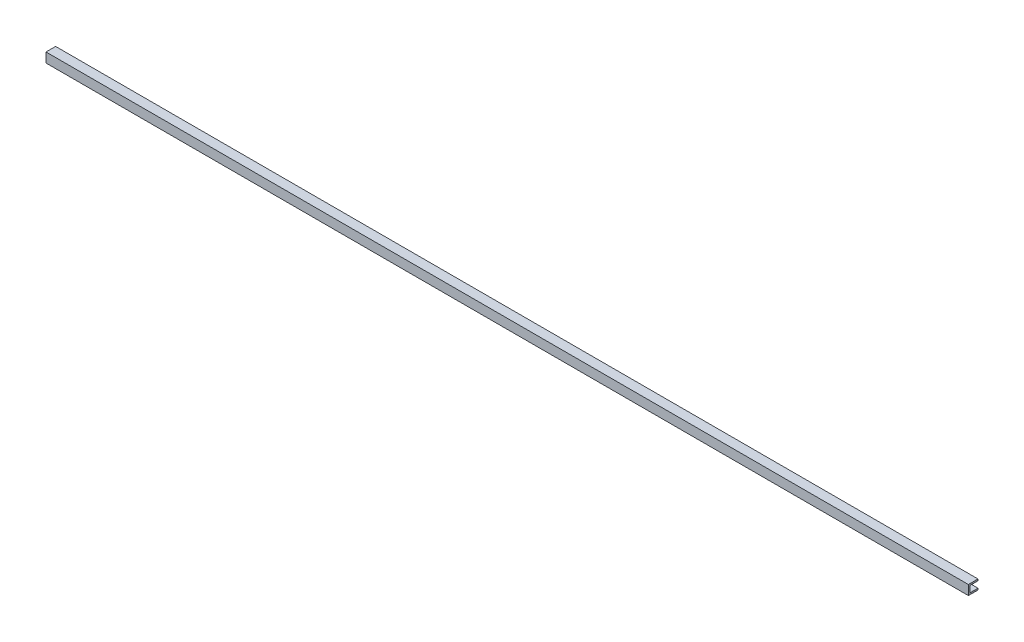
ISO-10303-21;
HEADER;
FILE_DESCRIPTION(('STEP AP214'),'2;1');
FILE_NAME('part.step','',(''),(''),'','','');
FILE_SCHEMA(('AUTOMOTIVE_DESIGN { 1 0 10303 214 1 1 1 1 }'));
ENDSEC;
DATA;
#1=APPLICATION_CONTEXT('core data for automotive mechanical design processes');
#2=APPLICATION_PROTOCOL_DEFINITION('international standard','automotive_design',2000,#1);
#3=PRODUCT_CONTEXT('',#1,'mechanical');
#4=PRODUCT('Part','Part','',(#3));
#5=PRODUCT_RELATED_PRODUCT_CATEGORY('part','',(#4));
#6=PRODUCT_DEFINITION_FORMATION('','',#4);
#7=PRODUCT_DEFINITION_CONTEXT('part definition',#1,'design');
#8=PRODUCT_DEFINITION('design','',#6,#7);
#9=PRODUCT_DEFINITION_SHAPE('','',#8);
#10=(LENGTH_UNIT() NAMED_UNIT(*) SI_UNIT(.MILLI.,.METRE.));
#11=(NAMED_UNIT(*) PLANE_ANGLE_UNIT() SI_UNIT($,.RADIAN.));
#12=(NAMED_UNIT(*) SI_UNIT($,.STERADIAN.) SOLID_ANGLE_UNIT());
#13=UNCERTAINTY_MEASURE_WITH_UNIT(LENGTH_MEASURE(1.E-05),#10,'distance_accuracy_value','');
#14=(GEOMETRIC_REPRESENTATION_CONTEXT(3) GLOBAL_UNCERTAINTY_ASSIGNED_CONTEXT((#13)) GLOBAL_UNIT_ASSIGNED_CONTEXT((#10,
#11,#12)) REPRESENTATION_CONTEXT('',''));
#15=CARTESIAN_POINT('',(0.,0.,0.));
#16=DIRECTION('',(0.,0.,1.));
#17=DIRECTION('',(1.,0.,0.));
#18=AXIS2_PLACEMENT_3D('',#15,#16,#17);
#19=CARTESIAN_POINT('',(-914.4,-9.525,0.));
#20=DIRECTION('',(0.,-1.,0.));
#21=DIRECTION('',(0.,0.,-1.));
#22=AXIS2_PLACEMENT_3D('',#19,#20,#21);
#23=PLANE('',#22);
#24=DIRECTION('',(1.,0.,0.));
#25=VECTOR('',#24,1.);
#26=CARTESIAN_POINT('',(-914.4,-9.525,0.));
#27=LINE('',#26,#25);
#28=CARTESIAN_POINT('',(-914.4,-9.525,0.));
#29=VERTEX_POINT('',#28);
#30=CARTESIAN_POINT('',(914.4,-9.525,0.));
#31=VERTEX_POINT('',#30);
#32=EDGE_CURVE('E84',#29,#31,#27,.T.);
#33=ORIENTED_EDGE('',*,*,#32,.F.);
#34=DIRECTION('',(0.,0.,-1.));
#35=VECTOR('',#34,1.);
#36=CARTESIAN_POINT('',(-914.4,-9.525,0.));
#37=LINE('',#36,#35);
#38=CARTESIAN_POINT('',(-914.4,-9.525,-19.05));
#39=VERTEX_POINT('',#38);
#40=EDGE_CURVE('E123',#29,#39,#37,.T.);
#41=ORIENTED_EDGE('',*,*,#40,.T.);
#42=DIRECTION('',(-1.,0.,0.));
#43=VECTOR('',#42,1.);
#44=CARTESIAN_POINT('',(-914.4,-9.525,-19.05));
#45=LINE('',#44,#43);
#46=CARTESIAN_POINT('',(914.4,-9.525,-19.05));
#47=VERTEX_POINT('',#46);
#48=EDGE_CURVE('E20',#47,#39,#45,.T.);
#49=ORIENTED_EDGE('',*,*,#48,.F.);
#50=DIRECTION('',(0.,0.,-1.));
#51=VECTOR('',#50,1.);
#52=CARTESIAN_POINT('',(914.4,-9.525,0.));
#53=LINE('',#52,#51);
#54=EDGE_CURVE('E95',#31,#47,#53,.T.);
#55=ORIENTED_EDGE('',*,*,#54,.F.);
#56=EDGE_LOOP('',(#33,#41,#49,#55));
#57=FACE_BOUND('',#56,.T.);
#58=ADVANCED_FACE('F17',(#57),#23,.T.);
#59=CARTESIAN_POINT('',(-914.4,-9.525,-19.05));
#60=DIRECTION('',(0.,0.,-1.));
#61=DIRECTION('',(-1.,0.,0.));
#62=AXIS2_PLACEMENT_3D('',#59,#60,#61);
#63=PLANE('',#62);
#64=ORIENTED_EDGE('',*,*,#48,.T.);
#65=DIRECTION('',(0.,1.,0.));
#66=VECTOR('',#65,1.);
#67=CARTESIAN_POINT('',(-914.4,0.,-19.05));
#68=LINE('',#67,#66);
#69=CARTESIAN_POINT('',(-914.4,-6.35,-19.05));
#70=VERTEX_POINT('',#69);
#71=EDGE_CURVE('E119',#39,#70,#68,.T.);
#72=ORIENTED_EDGE('',*,*,#71,.T.);
#73=DIRECTION('',(1.,0.,0.));
#74=VECTOR('',#73,1.);
#75=CARTESIAN_POINT('',(-914.4,-6.35,-19.05));
#76=LINE('',#75,#74);
#77=CARTESIAN_POINT('',(914.4,-6.35,-19.05));
#78=VERTEX_POINT('',#77);
#79=EDGE_CURVE('E111',#78,#70,#76,.F.);
#80=ORIENTED_EDGE('',*,*,#79,.F.);
#81=DIRECTION('',(0.,1.,0.));
#82=VECTOR('',#81,1.);
#83=CARTESIAN_POINT('',(914.4,0.,-19.05));
#84=LINE('',#83,#82);
#85=EDGE_CURVE('E98',#47,#78,#84,.T.);
#86=ORIENTED_EDGE('',*,*,#85,.F.);
#87=EDGE_LOOP('',(#64,#72,#80,#86));
#88=FACE_BOUND('',#87,.T.);
#89=ADVANCED_FACE('F118',(#88),#63,.T.);
#90=CARTESIAN_POINT('',(-914.4,-6.35,-19.05));
#91=DIRECTION('',(0.,1.,0.));
#92=DIRECTION('',(0.,0.,1.));
#93=AXIS2_PLACEMENT_3D('',#90,#91,#92);
#94=PLANE('',#93);
#95=ORIENTED_EDGE('',*,*,#79,.T.);
#96=DIRECTION('',(0.,0.,-1.));
#97=VECTOR('',#96,1.);
#98=CARTESIAN_POINT('',(-914.4,-6.35,0.));
#99=LINE('',#98,#97);
#100=CARTESIAN_POINT('',(-914.4,-6.35,-3.175));
#101=VERTEX_POINT('',#100);
#102=EDGE_CURVE('E125',#70,#101,#99,.F.);
#103=ORIENTED_EDGE('',*,*,#102,.T.);
#104=DIRECTION('',(-1.,0.,0.));
#105=VECTOR('',#104,1.);
#106=CARTESIAN_POINT('',(-914.4,-6.35,-3.175));
#107=LINE('',#106,#105);
#108=CARTESIAN_POINT('',(914.4,-6.35,-3.175));
#109=VERTEX_POINT('',#108);
#110=EDGE_CURVE('E109',#109,#101,#107,.T.);
#111=ORIENTED_EDGE('',*,*,#110,.F.);
#112=DIRECTION('',(0.,0.,-1.));
#113=VECTOR('',#112,1.);
#114=CARTESIAN_POINT('',(914.4,-6.35,0.));
#115=LINE('',#114,#113);
#116=EDGE_CURVE('E143',#78,#109,#115,.F.);
#117=ORIENTED_EDGE('',*,*,#116,.F.);
#118=EDGE_LOOP('',(#95,#103,#111,#117));
#119=FACE_BOUND('',#118,.T.);
#120=ADVANCED_FACE('F146',(#119),#94,.T.);
#121=CARTESIAN_POINT('',(-914.4,-6.35,-3.175));
#122=DIRECTION('',(0.,0.,-1.));
#123=DIRECTION('',(-1.,0.,0.));
#124=AXIS2_PLACEMENT_3D('',#121,#122,#123);
#125=PLANE('',#124);
#126=ORIENTED_EDGE('',*,*,#110,.T.);
#127=DIRECTION('',(0.,1.,0.));
#128=VECTOR('',#127,1.);
#129=CARTESIAN_POINT('',(-914.4,0.,-3.175));
#130=LINE('',#129,#128);
#131=CARTESIAN_POINT('',(-914.4,6.35,-3.175));
#132=VERTEX_POINT('',#131);
#133=EDGE_CURVE('E127',#101,#132,#130,.T.);
#134=ORIENTED_EDGE('',*,*,#133,.T.);
#135=DIRECTION('',(1.,0.,0.));
#136=VECTOR('',#135,1.);
#137=CARTESIAN_POINT('',(-914.4,6.35,-3.175));
#138=LINE('',#137,#136);
#139=CARTESIAN_POINT('',(914.4,6.35,-3.175));
#140=VERTEX_POINT('',#139);
#141=EDGE_CURVE('E92',#140,#132,#138,.F.);
#142=ORIENTED_EDGE('',*,*,#141,.F.);
#143=DIRECTION('',(0.,1.,0.));
#144=VECTOR('',#143,1.);
#145=CARTESIAN_POINT('',(914.4,0.,-3.175));
#146=LINE('',#145,#144);
#147=EDGE_CURVE('E140',#109,#140,#146,.T.);
#148=ORIENTED_EDGE('',*,*,#147,.F.);
#149=EDGE_LOOP('',(#126,#134,#142,#148));
#150=FACE_BOUND('',#149,.T.);
#151=ADVANCED_FACE('F148',(#150),#125,.T.);
#152=CARTESIAN_POINT('',(-914.4,6.35,-3.175));
#153=DIRECTION('',(0.,-1.,0.));
#154=DIRECTION('',(0.,0.,-1.));
#155=AXIS2_PLACEMENT_3D('',#152,#153,#154);
#156=PLANE('',#155);
#157=ORIENTED_EDGE('',*,*,#141,.T.);
#158=DIRECTION('',(0.,0.,-1.));
#159=VECTOR('',#158,1.);
#160=CARTESIAN_POINT('',(-914.4,6.35,0.));
#161=LINE('',#160,#159);
#162=CARTESIAN_POINT('',(-914.4,6.35,-19.05));
#163=VERTEX_POINT('',#162);
#164=EDGE_CURVE('E163',#132,#163,#161,.T.);
#165=ORIENTED_EDGE('',*,*,#164,.T.);
#166=DIRECTION('',(-1.,0.,0.));
#167=VECTOR('',#166,1.);
#168=CARTESIAN_POINT('',(-914.4,6.35,-19.05));
#169=LINE('',#168,#167);
#170=CARTESIAN_POINT('',(914.4,6.35,-19.05));
#171=VERTEX_POINT('',#170);
#172=EDGE_CURVE('E133',#171,#163,#169,.T.);
#173=ORIENTED_EDGE('',*,*,#172,.F.);
#174=DIRECTION('',(0.,0.,-1.));
#175=VECTOR('',#174,1.);
#176=CARTESIAN_POINT('',(914.4,6.35,0.));
#177=LINE('',#176,#175);
#178=EDGE_CURVE('E138',#140,#171,#177,.T.);
#179=ORIENTED_EDGE('',*,*,#178,.F.);
#180=EDGE_LOOP('',(#157,#165,#173,#179));
#181=FACE_BOUND('',#180,.T.);
#182=ADVANCED_FACE('F152',(#181),#156,.T.);
#183=CARTESIAN_POINT('',(-914.4,9.525,0.));
#184=DIRECTION('',(0.,0.,1.));
#185=DIRECTION('',(1.,0.,0.));
#186=AXIS2_PLACEMENT_3D('',#183,#184,#185);
#187=PLANE('',#186);
#188=DIRECTION('',(1.,0.,0.));
#189=VECTOR('',#188,1.);
#190=CARTESIAN_POINT('',(-914.4,9.525,0.));
#191=LINE('',#190,#189);
#192=CARTESIAN_POINT('',(-914.4,9.525,0.));
#193=VERTEX_POINT('',#192);
#194=CARTESIAN_POINT('',(914.4,9.525,0.));
#195=VERTEX_POINT('',#194);
#196=EDGE_CURVE('E158',#193,#195,#191,.T.);
#197=ORIENTED_EDGE('',*,*,#196,.F.);
#198=DIRECTION('',(0.,1.,0.));
#199=VECTOR('',#198,1.);
#200=CARTESIAN_POINT('',(-914.4,0.,0.));
#201=LINE('',#200,#199);
#202=EDGE_CURVE('E90',#193,#29,#201,.F.);
#203=ORIENTED_EDGE('',*,*,#202,.T.);
#204=ORIENTED_EDGE('',*,*,#32,.T.);
#205=DIRECTION('',(0.,1.,0.));
#206=VECTOR('',#205,1.);
#207=CARTESIAN_POINT('',(914.4,0.,0.));
#208=LINE('',#207,#206);
#209=EDGE_CURVE('E87',#195,#31,#208,.F.);
#210=ORIENTED_EDGE('',*,*,#209,.F.);
#211=EDGE_LOOP('',(#197,#203,#204,#210));
#212=FACE_BOUND('',#211,.T.);
#213=ADVANCED_FACE('F85',(#212),#187,.T.);
#214=CARTESIAN_POINT('',(914.4,0.,0.));
#215=DIRECTION('',(1.,0.,0.));
#216=DIRECTION('',(0.,0.,-1.));
#217=AXIS2_PLACEMENT_3D('',#214,#215,#216);
#218=PLANE('',#217);
#219=DIRECTION('',(0.,1.,0.));
#220=VECTOR('',#219,1.);
#221=CARTESIAN_POINT('',(914.4,6.35,-19.05));
#222=LINE('',#221,#220);
#223=CARTESIAN_POINT('',(914.4,9.525,-19.05));
#224=VERTEX_POINT('',#223);
#225=EDGE_CURVE('E135',#224,#171,#222,.F.);
#226=ORIENTED_EDGE('',*,*,#225,.F.);
#227=DIRECTION('',(0.,0.,1.));
#228=VECTOR('',#227,1.);
#229=CARTESIAN_POINT('',(914.4,9.525,-19.05));
#230=LINE('',#229,#228);
#231=EDGE_CURVE('E102',#195,#224,#230,.F.);
#232=ORIENTED_EDGE('',*,*,#231,.F.);
#233=ORIENTED_EDGE('',*,*,#209,.T.);
#234=ORIENTED_EDGE('',*,*,#54,.T.);
#235=ORIENTED_EDGE('',*,*,#85,.T.);
#236=ORIENTED_EDGE('',*,*,#116,.T.);
#237=ORIENTED_EDGE('',*,*,#147,.T.);
#238=ORIENTED_EDGE('',*,*,#178,.T.);
#239=EDGE_LOOP('',(#226,#232,#233,#234,#235,#236,#237,#238));
#240=FACE_BOUND('',#239,.T.);
#241=ADVANCED_FACE('F100',(#240),#218,.T.);
#242=CARTESIAN_POINT('',(-914.4,6.35,-19.05));
#243=DIRECTION('',(0.,0.,-1.));
#244=DIRECTION('',(-1.,0.,0.));
#245=AXIS2_PLACEMENT_3D('',#242,#243,#244);
#246=PLANE('',#245);
#247=ORIENTED_EDGE('',*,*,#172,.T.);
#248=DIRECTION('',(0.,1.,0.));
#249=VECTOR('',#248,1.);
#250=CARTESIAN_POINT('',(-914.4,0.,-19.05));
#251=LINE('',#250,#249);
#252=CARTESIAN_POINT('',(-914.4,9.525,-19.05));
#253=VERTEX_POINT('',#252);
#254=EDGE_CURVE('E35',#163,#253,#251,.T.);
#255=ORIENTED_EDGE('',*,*,#254,.T.);
#256=DIRECTION('',(1.,0.,0.));
#257=VECTOR('',#256,1.);
#258=CARTESIAN_POINT('',(-914.4,9.525,-19.05));
#259=LINE('',#258,#257);
#260=EDGE_CURVE('E26',#224,#253,#259,.F.);
#261=ORIENTED_EDGE('',*,*,#260,.F.);
#262=ORIENTED_EDGE('',*,*,#225,.T.);
#263=EDGE_LOOP('',(#247,#255,#261,#262));
#264=FACE_BOUND('',#263,.T.);
#265=ADVANCED_FACE('F154',(#264),#246,.T.);
#266=CARTESIAN_POINT('',(-914.4,0.,0.));
#267=DIRECTION('',(1.,0.,0.));
#268=DIRECTION('',(0.,0.,-1.));
#269=AXIS2_PLACEMENT_3D('',#266,#267,#268);
#270=PLANE('',#269);
#271=ORIENTED_EDGE('',*,*,#164,.F.);
#272=ORIENTED_EDGE('',*,*,#133,.F.);
#273=ORIENTED_EDGE('',*,*,#102,.F.);
#274=ORIENTED_EDGE('',*,*,#71,.F.);
#275=ORIENTED_EDGE('',*,*,#40,.F.);
#276=ORIENTED_EDGE('',*,*,#202,.F.);
#277=DIRECTION('',(0.,0.,1.));
#278=VECTOR('',#277,1.);
#279=CARTESIAN_POINT('',(-914.4,9.525,-19.05));
#280=LINE('',#279,#278);
#281=EDGE_CURVE('E11',#253,#193,#280,.T.);
#282=ORIENTED_EDGE('',*,*,#281,.F.);
#283=ORIENTED_EDGE('',*,*,#254,.F.);
#284=EDGE_LOOP('',(#271,#272,#273,#274,#275,#276,#282,#283));
#285=FACE_BOUND('',#284,.T.);
#286=ADVANCED_FACE('F122',(#285),#270,.F.);
#287=CARTESIAN_POINT('',(-914.4,9.525,-19.05));
#288=DIRECTION('',(0.,1.,0.));
#289=DIRECTION('',(0.,0.,1.));
#290=AXIS2_PLACEMENT_3D('',#287,#288,#289);
#291=PLANE('',#290);
#292=ORIENTED_EDGE('',*,*,#260,.T.);
#293=ORIENTED_EDGE('',*,*,#281,.T.);
#294=ORIENTED_EDGE('',*,*,#196,.T.);
#295=ORIENTED_EDGE('',*,*,#231,.T.);
#296=EDGE_LOOP('',(#292,#293,#294,#295));
#297=FACE_BOUND('',#296,.T.);
#298=ADVANCED_FACE('F157',(#297),#291,.T.);
#299=CLOSED_SHELL('',(#58,#89,#120,#151,#182,#213,#241,#265,#286,#298));
#300=MANIFOLD_SOLID_BREP('B1',#299);
#301=ADVANCED_BREP_SHAPE_REPRESENTATION('',(#18,#300),#14);
#302=SHAPE_DEFINITION_REPRESENTATION(#9,#301);
ENDSEC;
END-ISO-10303-21;
